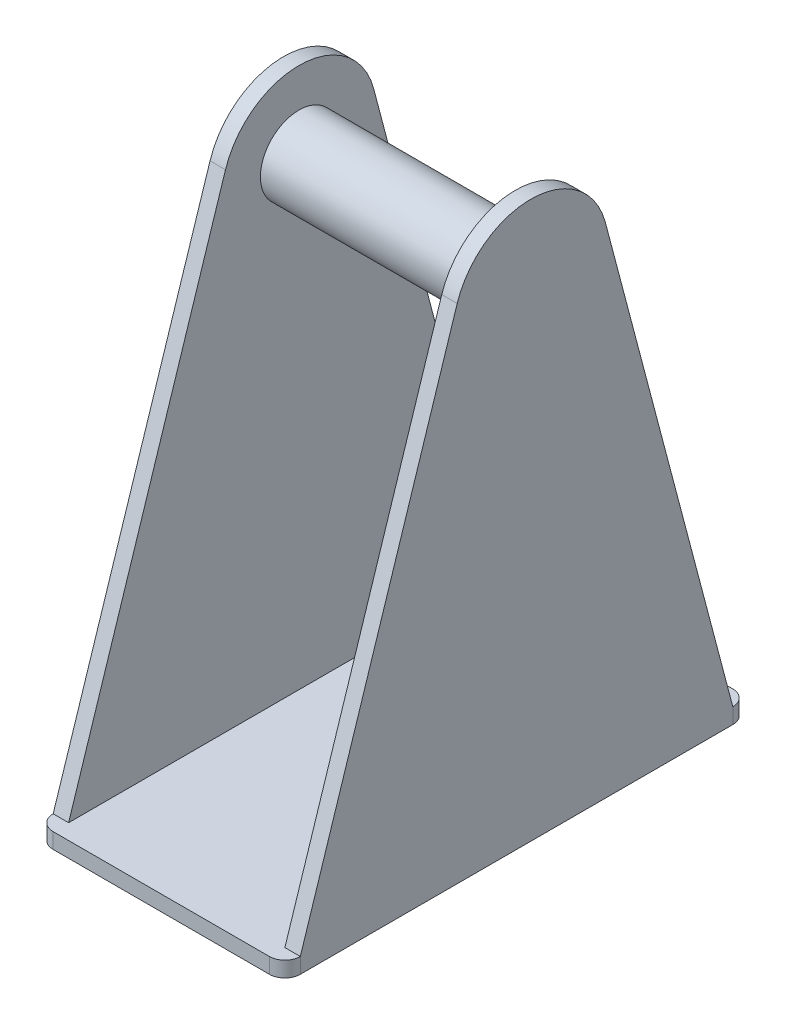
ISO-10303-21;
HEADER;
FILE_DESCRIPTION(('STEP AP214'),'2;1');
FILE_NAME('part.step','',(''),(''),'','','');
FILE_SCHEMA(('AUTOMOTIVE_DESIGN { 1 0 10303 214 1 1 1 1 }'));
ENDSEC;
DATA;
#1=APPLICATION_CONTEXT('core data for automotive mechanical design processes');
#2=APPLICATION_PROTOCOL_DEFINITION('international standard','automotive_design',2000,#1);
#3=PRODUCT_CONTEXT('',#1,'mechanical');
#4=PRODUCT('Part','Part','',(#3));
#5=PRODUCT_RELATED_PRODUCT_CATEGORY('part','',(#4));
#6=PRODUCT_DEFINITION_FORMATION('','',#4);
#7=PRODUCT_DEFINITION_CONTEXT('part definition',#1,'design');
#8=PRODUCT_DEFINITION('design','',#6,#7);
#9=PRODUCT_DEFINITION_SHAPE('','',#8);
#10=(LENGTH_UNIT() NAMED_UNIT(*) SI_UNIT(.MILLI.,.METRE.));
#11=(NAMED_UNIT(*) PLANE_ANGLE_UNIT() SI_UNIT($,.RADIAN.));
#12=(NAMED_UNIT(*) SI_UNIT($,.STERADIAN.) SOLID_ANGLE_UNIT());
#13=UNCERTAINTY_MEASURE_WITH_UNIT(LENGTH_MEASURE(1.E-05),#10,'distance_accuracy_value','');
#14=(GEOMETRIC_REPRESENTATION_CONTEXT(3) GLOBAL_UNCERTAINTY_ASSIGNED_CONTEXT((#13)) GLOBAL_UNIT_ASSIGNED_CONTEXT((#10,
#11,#12)) REPRESENTATION_CONTEXT('',''));
#15=CARTESIAN_POINT('',(0.,0.,0.));
#16=DIRECTION('',(0.,0.,1.));
#17=DIRECTION('',(1.,0.,0.));
#18=AXIS2_PLACEMENT_3D('',#15,#16,#17);
#19=CARTESIAN_POINT('',(-7.,1.,14.));
#20=DIRECTION('',(0.,1.,0.));
#21=DIRECTION('',(0.,0.,1.));
#22=AXIS2_PLACEMENT_3D('',#19,#20,#21);
#23=PLANE('',#22);
#24=CARTESIAN_POINT('',(7.,1.,14.));
#25=DIRECTION('',(0.,1.,0.));
#26=DIRECTION('',(0.,0.,1.));
#27=AXIS2_PLACEMENT_3D('',#24,#25,#26);
#28=CIRCLE('',#27,1.);
#29=CARTESIAN_POINT('',(7.,1.,15.));
#30=VERTEX_POINT('',#29);
#31=CARTESIAN_POINT('',(8.00000000000001,1.,14.));
#32=VERTEX_POINT('',#31);
#33=EDGE_CURVE('E236',#30,#32,#28,.T.);
#34=ORIENTED_EDGE('',*,*,#33,.T.);
#35=DIRECTION('',(1.,0.,0.));
#36=VECTOR('',#35,1.);
#37=CARTESIAN_POINT('',(7.,1.,14.));
#38=LINE('',#37,#36);
#39=CARTESIAN_POINT('',(7.,1.,14.));
#40=VERTEX_POINT('',#39);
#41=EDGE_CURVE('E60',#40,#32,#38,.T.);
#42=ORIENTED_EDGE('',*,*,#41,.F.);
#43=DIRECTION('',(0.,0.,1.));
#44=VECTOR('',#43,1.);
#45=CARTESIAN_POINT('',(7.,1.,14.));
#46=LINE('',#45,#44);
#47=CARTESIAN_POINT('',(6.99999999999999,1.,-14.));
#48=VERTEX_POINT('',#47);
#49=EDGE_CURVE('E55',#48,#40,#46,.T.);
#50=ORIENTED_EDGE('',*,*,#49,.F.);
#51=DIRECTION('',(1.,0.,0.));
#52=VECTOR('',#51,1.);
#53=CARTESIAN_POINT('',(6.99999999999999,1.,-14.));
#54=LINE('',#53,#52);
#55=CARTESIAN_POINT('',(7.99999999999999,1.,-14.));
#56=VERTEX_POINT('',#55);
#57=EDGE_CURVE('E162',#48,#56,#54,.T.);
#58=ORIENTED_EDGE('',*,*,#57,.T.);
#59=CARTESIAN_POINT('',(7.,1.,-14.));
#60=DIRECTION('',(0.,1.,0.));
#61=DIRECTION('',(0.,0.,1.));
#62=AXIS2_PLACEMENT_3D('',#59,#60,#61);
#63=CIRCLE('',#62,1.);
#64=CARTESIAN_POINT('',(7.,1.,-15.));
#65=VERTEX_POINT('',#64);
#66=EDGE_CURVE('E239',#56,#65,#63,.T.);
#67=ORIENTED_EDGE('',*,*,#66,.T.);
#68=DIRECTION('',(-1.,0.,0.));
#69=VECTOR('',#68,1.);
#70=CARTESIAN_POINT('',(-7.,1.,-15.));
#71=LINE('',#70,#69);
#72=CARTESIAN_POINT('',(-7.,1.,-15.));
#73=VERTEX_POINT('',#72);
#74=EDGE_CURVE('E242',#65,#73,#71,.T.);
#75=ORIENTED_EDGE('',*,*,#74,.T.);
#76=CARTESIAN_POINT('',(-7.,1.,-14.));
#77=DIRECTION('',(0.,1.,0.));
#78=DIRECTION('',(0.,0.,-1.));
#79=AXIS2_PLACEMENT_3D('',#76,#77,#78);
#80=CIRCLE('',#79,1.);
#81=CARTESIAN_POINT('',(-7.99999999999999,1.,-14.));
#82=VERTEX_POINT('',#81);
#83=EDGE_CURVE('E245',#73,#82,#80,.T.);
#84=ORIENTED_EDGE('',*,*,#83,.T.);
#85=DIRECTION('',(-1.,0.,0.));
#86=VECTOR('',#85,1.);
#87=CARTESIAN_POINT('',(-6.99999999999999,1.,-14.));
#88=LINE('',#87,#86);
#89=CARTESIAN_POINT('',(-6.99999999999999,1.,-14.));
#90=VERTEX_POINT('',#89);
#91=EDGE_CURVE('E215',#90,#82,#88,.T.);
#92=ORIENTED_EDGE('',*,*,#91,.F.);
#93=DIRECTION('',(0.,0.,1.));
#94=VECTOR('',#93,1.);
#95=CARTESIAN_POINT('',(-7.,1.,14.));
#96=LINE('',#95,#94);
#97=CARTESIAN_POINT('',(-7.,1.,14.));
#98=VERTEX_POINT('',#97);
#99=EDGE_CURVE('E187',#90,#98,#96,.T.);
#100=ORIENTED_EDGE('',*,*,#99,.T.);
#101=DIRECTION('',(-1.,0.,0.));
#102=VECTOR('',#101,1.);
#103=CARTESIAN_POINT('',(-7.,1.,14.));
#104=LINE('',#103,#102);
#105=CARTESIAN_POINT('',(-7.99999999999999,1.,14.));
#106=VERTEX_POINT('',#105);
#107=EDGE_CURVE('E204',#98,#106,#104,.T.);
#108=ORIENTED_EDGE('',*,*,#107,.T.);
#109=CARTESIAN_POINT('',(-7.,1.,14.));
#110=DIRECTION('',(0.,1.,0.));
#111=DIRECTION('',(0.,0.,1.));
#112=AXIS2_PLACEMENT_3D('',#109,#110,#111);
#113=CIRCLE('',#112,0.999999999999999);
#114=CARTESIAN_POINT('',(-7.,1.,15.));
#115=VERTEX_POINT('',#114);
#116=EDGE_CURVE('E228',#106,#115,#113,.T.);
#117=ORIENTED_EDGE('',*,*,#116,.T.);
#118=DIRECTION('',(1.,0.,0.));
#119=VECTOR('',#118,1.);
#120=CARTESIAN_POINT('',(-7.,1.,15.));
#121=LINE('',#120,#119);
#122=EDGE_CURVE('E232',#115,#30,#121,.T.);
#123=ORIENTED_EDGE('',*,*,#122,.T.);
#124=EDGE_LOOP('',(#34,#42,#50,#58,#67,#75,#84,#92,#100,#108,#117,#123));
#125=FACE_BOUND('',#124,.T.);
#126=ADVANCED_FACE('F39',(#125),#23,.T.);
#127=CARTESIAN_POINT('',(-7.,1.,14.));
#128=DIRECTION('',(0.,-1.,0.));
#129=DIRECTION('',(0.,0.,-1.));
#130=AXIS2_PLACEMENT_3D('',#127,#128,#129);
#131=CYLINDRICAL_SURFACE('',#130,0.999999999999999);
#132=CARTESIAN_POINT('',(-7.,0.,14.));
#133=DIRECTION('',(0.,1.,0.));
#134=DIRECTION('',(0.,0.,1.));
#135=AXIS2_PLACEMENT_3D('',#132,#133,#134);
#136=CIRCLE('',#135,0.999999999999999);
#137=CARTESIAN_POINT('',(-7.99999999999999,0.,14.));
#138=VERTEX_POINT('',#137);
#139=CARTESIAN_POINT('',(-7.,0.,15.));
#140=VERTEX_POINT('',#139);
#141=EDGE_CURVE('E218',#138,#140,#136,.T.);
#142=ORIENTED_EDGE('',*,*,#141,.T.);
#143=DIRECTION('',(0.,-1.,0.));
#144=VECTOR('',#143,1.);
#145=CARTESIAN_POINT('',(-7.,1.,15.));
#146=LINE('',#145,#144);
#147=EDGE_CURVE('E300',#115,#140,#146,.T.);
#148=ORIENTED_EDGE('',*,*,#147,.F.);
#149=ORIENTED_EDGE('',*,*,#116,.F.);
#150=DIRECTION('',(0.,-1.,0.));
#151=VECTOR('',#150,1.);
#152=CARTESIAN_POINT('',(-7.99999999999999,1.,14.));
#153=LINE('',#152,#151);
#154=EDGE_CURVE('E249',#106,#138,#153,.T.);
#155=ORIENTED_EDGE('',*,*,#154,.T.);
#156=EDGE_LOOP('',(#142,#148,#149,#155));
#157=FACE_BOUND('',#156,.T.);
#158=ADVANCED_FACE('F41',(#157),#131,.T.);
#159=CARTESIAN_POINT('',(-7.,1.,15.));
#160=DIRECTION('',(0.,0.,-1.));
#161=DIRECTION('',(-1.,0.,0.));
#162=AXIS2_PLACEMENT_3D('',#159,#160,#161);
#163=PLANE('',#162);
#164=DIRECTION('',(1.,0.,0.));
#165=VECTOR('',#164,1.);
#166=CARTESIAN_POINT('',(-7.,0.,15.));
#167=LINE('',#166,#165);
#168=CARTESIAN_POINT('',(7.,0.,15.));
#169=VERTEX_POINT('',#168);
#170=EDGE_CURVE('E253',#140,#169,#167,.T.);
#171=ORIENTED_EDGE('',*,*,#170,.T.);
#172=DIRECTION('',(0.,-1.,0.));
#173=VECTOR('',#172,1.);
#174=CARTESIAN_POINT('',(7.,1.,15.));
#175=LINE('',#174,#173);
#176=EDGE_CURVE('E296',#30,#169,#175,.T.);
#177=ORIENTED_EDGE('',*,*,#176,.F.);
#178=ORIENTED_EDGE('',*,*,#122,.F.);
#179=ORIENTED_EDGE('',*,*,#147,.T.);
#180=EDGE_LOOP('',(#171,#177,#178,#179));
#181=FACE_BOUND('',#180,.T.);
#182=ADVANCED_FACE('F326',(#181),#163,.F.);
#183=CARTESIAN_POINT('',(7.,1.,14.));
#184=DIRECTION('',(0.,-1.,0.));
#185=DIRECTION('',(0.,0.,-1.));
#186=AXIS2_PLACEMENT_3D('',#183,#184,#185);
#187=CYLINDRICAL_SURFACE('',#186,1.);
#188=CARTESIAN_POINT('',(7.,0.,14.));
#189=DIRECTION('',(0.,1.,0.));
#190=DIRECTION('',(0.,0.,1.));
#191=AXIS2_PLACEMENT_3D('',#188,#189,#190);
#192=CIRCLE('',#191,1.);
#193=CARTESIAN_POINT('',(8.00000000000001,0.,14.));
#194=VERTEX_POINT('',#193);
#195=EDGE_CURVE('E256',#169,#194,#192,.T.);
#196=ORIENTED_EDGE('',*,*,#195,.T.);
#197=DIRECTION('',(0.,-1.,0.));
#198=VECTOR('',#197,1.);
#199=CARTESIAN_POINT('',(8.00000000000001,1.,14.));
#200=LINE('',#199,#198);
#201=EDGE_CURVE('E292',#32,#194,#200,.T.);
#202=ORIENTED_EDGE('',*,*,#201,.F.);
#203=ORIENTED_EDGE('',*,*,#33,.F.);
#204=ORIENTED_EDGE('',*,*,#176,.T.);
#205=EDGE_LOOP('',(#196,#202,#203,#204));
#206=FACE_BOUND('',#205,.T.);
#207=ADVANCED_FACE('F356',(#206),#187,.T.);
#208=CARTESIAN_POINT('',(8.,1.,-14.));
#209=DIRECTION('',(-1.,0.,0.));
#210=DIRECTION('',(0.,0.,1.));
#211=AXIS2_PLACEMENT_3D('',#208,#209,#210);
#212=PLANE('',#211);
#213=DIRECTION('',(0.,0.,-1.));
#214=VECTOR('',#213,1.);
#215=CARTESIAN_POINT('',(8.,0.,-14.));
#216=LINE('',#215,#214);
#217=CARTESIAN_POINT('',(8.,0.,-14.));
#218=VERTEX_POINT('',#217);
#219=EDGE_CURVE('E259',#194,#218,#216,.T.);
#220=ORIENTED_EDGE('',*,*,#219,.T.);
#221=DIRECTION('',(0.,-1.,0.));
#222=VECTOR('',#221,1.);
#223=CARTESIAN_POINT('',(8.,1.,-14.));
#224=LINE('',#223,#222);
#225=EDGE_CURVE('E288',#56,#218,#224,.T.);
#226=ORIENTED_EDGE('',*,*,#225,.F.);
#227=DIRECTION('',(0.,-0.966918279333159,-0.255086340464174));
#228=VECTOR('',#227,1.);
#229=CARTESIAN_POINT('',(8.,32.2754317023209,-5.74911097462728));
#230=LINE('',#229,#228);
#231=CARTESIAN_POINT('',(8.,32.2754317023209,-5.74911097462729));
#232=VERTEX_POINT('',#231);
#233=EDGE_CURVE('E173',#232,#56,#230,.T.);
#234=ORIENTED_EDGE('',*,*,#233,.F.);
#235=CARTESIAN_POINT('',(8.,31.,-0.914519577961492));
#236=DIRECTION('',(-1.,0.,0.));
#237=DIRECTION('',(0.,0.,1.));
#238=AXIS2_PLACEMENT_3D('',#235,#236,#237);
#239=CIRCLE('',#238,5.);
#240=CARTESIAN_POINT('',(8.,32.5327433087256,3.84475536151794));
#241=VERTEX_POINT('',#240);
#242=EDGE_CURVE('E156',#241,#232,#239,.T.);
#243=ORIENTED_EDGE('',*,*,#242,.F.);
#244=DIRECTION('',(0.,0.951854987895886,-0.306548661745116));
#245=VECTOR('',#244,1.);
#246=CARTESIAN_POINT('',(8.,1.,14.));
#247=LINE('',#246,#245);
#248=EDGE_CURVE('E168',#32,#241,#247,.T.);
#249=ORIENTED_EDGE('',*,*,#248,.F.);
#250=ORIENTED_EDGE('',*,*,#201,.T.);
#251=EDGE_LOOP('',(#220,#226,#234,#243,#249,#250));
#252=FACE_BOUND('',#251,.T.);
#253=ADVANCED_FACE('F352',(#252),#212,.F.);
#254=CARTESIAN_POINT('',(7.,1.,-14.));
#255=DIRECTION('',(0.,-1.,0.));
#256=DIRECTION('',(0.,0.,-1.));
#257=AXIS2_PLACEMENT_3D('',#254,#255,#256);
#258=CYLINDRICAL_SURFACE('',#257,1.);
#259=CARTESIAN_POINT('',(7.,0.,-14.));
#260=DIRECTION('',(0.,1.,0.));
#261=DIRECTION('',(0.,0.,1.));
#262=AXIS2_PLACEMENT_3D('',#259,#260,#261);
#263=CIRCLE('',#262,1.);
#264=CARTESIAN_POINT('',(7.,0.,-15.));
#265=VERTEX_POINT('',#264);
#266=EDGE_CURVE('E262',#218,#265,#263,.T.);
#267=ORIENTED_EDGE('',*,*,#266,.T.);
#268=DIRECTION('',(0.,-1.,0.));
#269=VECTOR('',#268,1.);
#270=CARTESIAN_POINT('',(7.,1.,-15.));
#271=LINE('',#270,#269);
#272=EDGE_CURVE('E284',#65,#265,#271,.T.);
#273=ORIENTED_EDGE('',*,*,#272,.F.);
#274=ORIENTED_EDGE('',*,*,#66,.F.);
#275=ORIENTED_EDGE('',*,*,#225,.T.);
#276=EDGE_LOOP('',(#267,#273,#274,#275));
#277=FACE_BOUND('',#276,.T.);
#278=ADVANCED_FACE('F348',(#277),#258,.T.);
#279=CARTESIAN_POINT('',(-7.,1.,-15.));
#280=DIRECTION('',(0.,0.,1.));
#281=DIRECTION('',(1.,0.,0.));
#282=AXIS2_PLACEMENT_3D('',#279,#280,#281);
#283=PLANE('',#282);
#284=DIRECTION('',(-1.,0.,0.));
#285=VECTOR('',#284,1.);
#286=CARTESIAN_POINT('',(-7.,0.,-15.));
#287=LINE('',#286,#285);
#288=CARTESIAN_POINT('',(-7.,0.,-15.));
#289=VERTEX_POINT('',#288);
#290=EDGE_CURVE('E265',#265,#289,#287,.T.);
#291=ORIENTED_EDGE('',*,*,#290,.T.);
#292=DIRECTION('',(0.,-1.,0.));
#293=VECTOR('',#292,1.);
#294=CARTESIAN_POINT('',(-7.,1.,-15.));
#295=LINE('',#294,#293);
#296=EDGE_CURVE('E280',#73,#289,#295,.T.);
#297=ORIENTED_EDGE('',*,*,#296,.F.);
#298=ORIENTED_EDGE('',*,*,#74,.F.);
#299=ORIENTED_EDGE('',*,*,#272,.T.);
#300=EDGE_LOOP('',(#291,#297,#298,#299));
#301=FACE_BOUND('',#300,.T.);
#302=ADVANCED_FACE('F344',(#301),#283,.F.);
#303=CARTESIAN_POINT('',(-7.,1.,-14.));
#304=DIRECTION('',(0.,-1.,0.));
#305=DIRECTION('',(0.,0.,-1.));
#306=AXIS2_PLACEMENT_3D('',#303,#304,#305);
#307=CYLINDRICAL_SURFACE('',#306,1.);
#308=CARTESIAN_POINT('',(-7.,0.,-14.));
#309=DIRECTION('',(0.,1.,0.));
#310=DIRECTION('',(0.,0.,-1.));
#311=AXIS2_PLACEMENT_3D('',#308,#309,#310);
#312=CIRCLE('',#311,1.);
#313=CARTESIAN_POINT('',(-8.,0.,-14.));
#314=VERTEX_POINT('',#313);
#315=EDGE_CURVE('E268',#289,#314,#312,.T.);
#316=ORIENTED_EDGE('',*,*,#315,.T.);
#317=DIRECTION('',(0.,-1.,0.));
#318=VECTOR('',#317,1.);
#319=CARTESIAN_POINT('',(-8.,1.,-14.));
#320=LINE('',#319,#318);
#321=EDGE_CURVE('E276',#82,#314,#320,.T.);
#322=ORIENTED_EDGE('',*,*,#321,.F.);
#323=ORIENTED_EDGE('',*,*,#83,.F.);
#324=ORIENTED_EDGE('',*,*,#296,.T.);
#325=EDGE_LOOP('',(#316,#322,#323,#324));
#326=FACE_BOUND('',#325,.T.);
#327=ADVANCED_FACE('F340',(#326),#307,.T.);
#328=CARTESIAN_POINT('',(-8.,1.,-14.));
#329=DIRECTION('',(1.,0.,0.));
#330=DIRECTION('',(0.,0.,-1.));
#331=AXIS2_PLACEMENT_3D('',#328,#329,#330);
#332=PLANE('',#331);
#333=DIRECTION('',(0.,0.,1.));
#334=VECTOR('',#333,1.);
#335=CARTESIAN_POINT('',(-8.,0.,-14.));
#336=LINE('',#335,#334);
#337=EDGE_CURVE('E233',#314,#138,#336,.T.);
#338=ORIENTED_EDGE('',*,*,#337,.T.);
#339=ORIENTED_EDGE('',*,*,#154,.F.);
#340=DIRECTION('',(0.,0.951854987895886,-0.306548661745116));
#341=VECTOR('',#340,1.);
#342=CARTESIAN_POINT('',(-8.,1.,14.));
#343=LINE('',#342,#341);
#344=CARTESIAN_POINT('',(-8.,32.5327433087256,3.84475536151794));
#345=VERTEX_POINT('',#344);
#346=EDGE_CURVE('E182',#106,#345,#343,.T.);
#347=ORIENTED_EDGE('',*,*,#346,.T.);
#348=CARTESIAN_POINT('',(-8.,31.,-0.914519577961492));
#349=DIRECTION('',(-1.,0.,0.));
#350=DIRECTION('',(0.,0.,1.));
#351=AXIS2_PLACEMENT_3D('',#348,#349,#350);
#352=CIRCLE('',#351,5.);
#353=CARTESIAN_POINT('',(-8.,32.2754317023209,-5.74911097462729));
#354=VERTEX_POINT('',#353);
#355=EDGE_CURVE('E208',#345,#354,#352,.T.);
#356=ORIENTED_EDGE('',*,*,#355,.T.);
#357=DIRECTION('',(0.,-0.966918279333159,-0.255086340464174));
#358=VECTOR('',#357,1.);
#359=CARTESIAN_POINT('',(-8.,32.2754317023209,-5.74911097462728));
#360=LINE('',#359,#358);
#361=EDGE_CURVE('E192',#354,#82,#360,.T.);
#362=ORIENTED_EDGE('',*,*,#361,.T.);
#363=ORIENTED_EDGE('',*,*,#321,.T.);
#364=EDGE_LOOP('',(#338,#339,#347,#356,#362,#363));
#365=FACE_BOUND('',#364,.T.);
#366=ADVANCED_FACE('F336',(#365),#332,.F.);
#367=CARTESIAN_POINT('',(-7.,0.,14.));
#368=DIRECTION('',(0.,1.,0.));
#369=DIRECTION('',(0.,0.,1.));
#370=AXIS2_PLACEMENT_3D('',#367,#368,#369);
#371=PLANE('',#370);
#372=ORIENTED_EDGE('',*,*,#141,.F.);
#373=ORIENTED_EDGE('',*,*,#337,.F.);
#374=ORIENTED_EDGE('',*,*,#315,.F.);
#375=ORIENTED_EDGE('',*,*,#290,.F.);
#376=ORIENTED_EDGE('',*,*,#266,.F.);
#377=ORIENTED_EDGE('',*,*,#219,.F.);
#378=ORIENTED_EDGE('',*,*,#195,.F.);
#379=ORIENTED_EDGE('',*,*,#170,.F.);
#380=EDGE_LOOP('',(#372,#373,#374,#375,#376,#377,#378,#379));
#381=FACE_BOUND('',#380,.T.);
#382=ADVANCED_FACE('F332',(#381),#371,.F.);
#383=CARTESIAN_POINT('',(-7.,32.2754317023209,-5.74911097462728));
#384=DIRECTION('',(0.,0.255086340464173,-0.966918279333158));
#385=DIRECTION('',(0.,0.966918279333159,0.255086340464174));
#386=AXIS2_PLACEMENT_3D('',#383,#384,#385);
#387=PLANE('',#386);
#388=ORIENTED_EDGE('',*,*,#361,.F.);
#389=DIRECTION('',(-1.,0.,0.));
#390=VECTOR('',#389,1.);
#391=CARTESIAN_POINT('',(-7.,32.2754317023209,-5.74911097462729));
#392=LINE('',#391,#390);
#393=CARTESIAN_POINT('',(-7.,32.2754317023209,-5.74911097462729));
#394=VERTEX_POINT('',#393);
#395=EDGE_CURVE('E219',#394,#354,#392,.T.);
#396=ORIENTED_EDGE('',*,*,#395,.F.);
#397=DIRECTION('',(0.,-0.966918279333159,-0.255086340464174));
#398=VECTOR('',#397,1.);
#399=CARTESIAN_POINT('',(-7.,32.2754317023209,-5.74911097462728));
#400=LINE('',#399,#398);
#401=EDGE_CURVE('E200',#394,#90,#400,.T.);
#402=ORIENTED_EDGE('',*,*,#401,.T.);
#403=ORIENTED_EDGE('',*,*,#91,.T.);
#404=EDGE_LOOP('',(#388,#396,#402,#403));
#405=FACE_BOUND('',#404,.T.);
#406=ADVANCED_FACE('F335',(#405),#387,.T.);
#407=CARTESIAN_POINT('',(-7.,31.,-0.914519577961492));
#408=DIRECTION('',(-1.,0.,0.));
#409=DIRECTION('',(0.,0.,1.));
#410=AXIS2_PLACEMENT_3D('',#407,#408,#409);
#411=CYLINDRICAL_SURFACE('',#410,5.);
#412=ORIENTED_EDGE('',*,*,#355,.F.);
#413=DIRECTION('',(-1.,0.,0.));
#414=VECTOR('',#413,1.);
#415=CARTESIAN_POINT('',(-7.,32.5327433087256,3.84475536151794));
#416=LINE('',#415,#414);
#417=CARTESIAN_POINT('',(-7.,32.5327433087256,3.84475536151794));
#418=VERTEX_POINT('',#417);
#419=EDGE_CURVE('E222',#418,#345,#416,.T.);
#420=ORIENTED_EDGE('',*,*,#419,.F.);
#421=CARTESIAN_POINT('',(-7.,31.,-0.914519577961492));
#422=DIRECTION('',(-1.,0.,0.));
#423=DIRECTION('',(0.,0.,1.));
#424=AXIS2_PLACEMENT_3D('',#421,#422,#423);
#425=CIRCLE('',#424,5.);
#426=EDGE_CURVE('E196',#418,#394,#425,.T.);
#427=ORIENTED_EDGE('',*,*,#426,.T.);
#428=ORIENTED_EDGE('',*,*,#395,.T.);
#429=EDGE_LOOP('',(#412,#420,#427,#428));
#430=FACE_BOUND('',#429,.T.);
#431=ADVANCED_FACE('F391',(#430),#411,.T.);
#432=CARTESIAN_POINT('',(-7.,1.,14.));
#433=DIRECTION('',(0.,0.306548661745116,0.951854987895886));
#434=DIRECTION('',(0.,-0.951854987895886,0.306548661745116));
#435=AXIS2_PLACEMENT_3D('',#432,#433,#434);
#436=PLANE('',#435);
#437=ORIENTED_EDGE('',*,*,#346,.F.);
#438=ORIENTED_EDGE('',*,*,#107,.F.);
#439=DIRECTION('',(0.,0.951854987895886,-0.306548661745116));
#440=VECTOR('',#439,1.);
#441=CARTESIAN_POINT('',(-7.,1.,14.));
#442=LINE('',#441,#440);
#443=EDGE_CURVE('E191',#98,#418,#442,.T.);
#444=ORIENTED_EDGE('',*,*,#443,.T.);
#445=ORIENTED_EDGE('',*,*,#419,.T.);
#446=EDGE_LOOP('',(#437,#438,#444,#445));
#447=FACE_BOUND('',#446,.T.);
#448=ADVANCED_FACE('F330',(#447),#436,.T.);
#449=CARTESIAN_POINT('',(-7.,31.,-0.914519577961492));
#450=DIRECTION('',(-1.,0.,0.));
#451=DIRECTION('',(0.,0.,1.));
#452=AXIS2_PLACEMENT_3D('',#449,#450,#451);
#453=PLANE('',#452);
#454=CARTESIAN_POINT('',(-7.,31.,-0.914519577961493));
#455=DIRECTION('',(-1.,0.,0.));
#456=DIRECTION('',(0.,0.,1.));
#457=AXIS2_PLACEMENT_3D('',#454,#455,#456);
#458=CIRCLE('',#457,2.5);
#459=CARTESIAN_POINT('',(-7.,31.,1.58548042203851));
#460=VERTEX_POINT('',#459);
#461=EDGE_CURVE('E11',#460,#460,#458,.F.);
#462=ORIENTED_EDGE('',*,*,#461,.F.);
#463=EDGE_LOOP('',(#462));
#464=FACE_BOUND('',#463,.T.);
#465=ORIENTED_EDGE('',*,*,#99,.F.);
#466=ORIENTED_EDGE('',*,*,#401,.F.);
#467=ORIENTED_EDGE('',*,*,#426,.F.);
#468=ORIENTED_EDGE('',*,*,#443,.F.);
#469=EDGE_LOOP('',(#465,#466,#467,#468));
#470=FACE_BOUND('',#469,.T.);
#471=ADVANCED_FACE('F381',(#464,#470),#453,.F.);
#472=CARTESIAN_POINT('',(7.,1.,14.));
#473=DIRECTION('',(0.,-0.306548661745116,-0.951854987895886));
#474=DIRECTION('',(0.,0.951854987895886,-0.306548661745116));
#475=AXIS2_PLACEMENT_3D('',#472,#473,#474);
#476=PLANE('',#475);
#477=ORIENTED_EDGE('',*,*,#248,.T.);
#478=DIRECTION('',(1.,0.,0.));
#479=VECTOR('',#478,1.);
#480=CARTESIAN_POINT('',(7.,32.5327433087256,3.84475536151794));
#481=LINE('',#480,#479);
#482=CARTESIAN_POINT('',(7.,32.5327433087256,3.84475536151794));
#483=VERTEX_POINT('',#482);
#484=EDGE_CURVE('E161',#483,#241,#481,.T.);
#485=ORIENTED_EDGE('',*,*,#484,.F.);
#486=DIRECTION('',(0.,0.951854987895886,-0.306548661745116));
#487=VECTOR('',#486,1.);
#488=CARTESIAN_POINT('',(7.,1.,14.));
#489=LINE('',#488,#487);
#490=EDGE_CURVE('E146',#40,#483,#489,.T.);
#491=ORIENTED_EDGE('',*,*,#490,.F.);
#492=ORIENTED_EDGE('',*,*,#41,.T.);
#493=EDGE_LOOP('',(#477,#485,#491,#492));
#494=FACE_BOUND('',#493,.T.);
#495=ADVANCED_FACE('F379',(#494),#476,.F.);
#496=CARTESIAN_POINT('',(7.,31.,-0.914519577961492));
#497=DIRECTION('',(1.,0.,0.));
#498=DIRECTION('',(0.,0.,-1.));
#499=AXIS2_PLACEMENT_3D('',#496,#497,#498);
#500=CYLINDRICAL_SURFACE('',#499,5.);
#501=ORIENTED_EDGE('',*,*,#242,.T.);
#502=DIRECTION('',(1.,0.,0.));
#503=VECTOR('',#502,1.);
#504=CARTESIAN_POINT('',(7.,32.2754317023209,-5.74911097462729));
#505=LINE('',#504,#503);
#506=CARTESIAN_POINT('',(7.,32.2754317023209,-5.74911097462729));
#507=VERTEX_POINT('',#506);
#508=EDGE_CURVE('E153',#507,#232,#505,.T.);
#509=ORIENTED_EDGE('',*,*,#508,.F.);
#510=CARTESIAN_POINT('',(7.,31.,-0.914519577961492));
#511=DIRECTION('',(-1.,0.,0.));
#512=DIRECTION('',(0.,0.,1.));
#513=AXIS2_PLACEMENT_3D('',#510,#511,#512);
#514=CIRCLE('',#513,5.);
#515=EDGE_CURVE('E140',#483,#507,#514,.T.);
#516=ORIENTED_EDGE('',*,*,#515,.F.);
#517=ORIENTED_EDGE('',*,*,#484,.T.);
#518=EDGE_LOOP('',(#501,#509,#516,#517));
#519=FACE_BOUND('',#518,.T.);
#520=ADVANCED_FACE('F154',(#519),#500,.T.);
#521=CARTESIAN_POINT('',(7.,32.2754317023209,-5.74911097462728));
#522=DIRECTION('',(0.,-0.255086340464173,0.966918279333158));
#523=DIRECTION('',(0.,-0.966918279333159,-0.255086340464174));
#524=AXIS2_PLACEMENT_3D('',#521,#522,#523);
#525=PLANE('',#524);
#526=ORIENTED_EDGE('',*,*,#233,.T.);
#527=ORIENTED_EDGE('',*,*,#57,.F.);
#528=DIRECTION('',(0.,-0.966918279333159,-0.255086340464174));
#529=VECTOR('',#528,1.);
#530=CARTESIAN_POINT('',(7.,32.2754317023209,-5.74911097462728));
#531=LINE('',#530,#529);
#532=EDGE_CURVE('E144',#507,#48,#531,.T.);
#533=ORIENTED_EDGE('',*,*,#532,.F.);
#534=ORIENTED_EDGE('',*,*,#508,.T.);
#535=EDGE_LOOP('',(#526,#527,#533,#534));
#536=FACE_BOUND('',#535,.T.);
#537=ADVANCED_FACE('F164',(#536),#525,.F.);
#538=CARTESIAN_POINT('',(7.,31.,-0.914519577961492));
#539=DIRECTION('',(1.,0.,0.));
#540=DIRECTION('',(0.,0.,1.));
#541=AXIS2_PLACEMENT_3D('',#538,#539,#540);
#542=PLANE('',#541);
#543=CARTESIAN_POINT('',(7.,31.,-0.914519577961492));
#544=DIRECTION('',(1.,0.,0.));
#545=DIRECTION('',(0.,0.,-1.));
#546=AXIS2_PLACEMENT_3D('',#543,#544,#545);
#547=CIRCLE('',#546,2.5);
#548=CARTESIAN_POINT('',(7.,31.,-3.41451957796149));
#549=VERTEX_POINT('',#548);
#550=EDGE_CURVE('E48',#549,#549,#547,.F.);
#551=ORIENTED_EDGE('',*,*,#550,.F.);
#552=EDGE_LOOP('',(#551));
#553=FACE_BOUND('',#552,.T.);
#554=ORIENTED_EDGE('',*,*,#49,.T.);
#555=ORIENTED_EDGE('',*,*,#490,.T.);
#556=ORIENTED_EDGE('',*,*,#515,.T.);
#557=ORIENTED_EDGE('',*,*,#532,.T.);
#558=EDGE_LOOP('',(#554,#555,#556,#557));
#559=FACE_BOUND('',#558,.T.);
#560=ADVANCED_FACE('F142',(#553,#559),#542,.F.);
#561=CARTESIAN_POINT('',(8.002,31.,-0.914519577961492));
#562=DIRECTION('',(-1.,0.,0.));
#563=DIRECTION('',(0.,0.,1.));
#564=AXIS2_PLACEMENT_3D('',#561,#562,#563);
#565=CYLINDRICAL_SURFACE('',#564,2.5);
#566=ORIENTED_EDGE('',*,*,#461,.T.);
#567=EDGE_LOOP('',(#566));
#568=FACE_BOUND('',#567,.T.);
#569=ORIENTED_EDGE('',*,*,#550,.T.);
#570=EDGE_LOOP('',(#569));
#571=FACE_BOUND('',#570,.T.);
#572=ADVANCED_FACE('F307',(#568,#571),#565,.T.);
#573=CLOSED_SHELL('',(#126,#158,#182,#207,#253,#278,#302,#327,#366,#382,#406,#431,#448,#471,
#495,#520,#537,#560,#572));
#574=MANIFOLD_SOLID_BREP('B2',#573);
#575=ADVANCED_BREP_SHAPE_REPRESENTATION('',(#18,#574),#14);
#576=SHAPE_DEFINITION_REPRESENTATION(#9,#575);
ENDSEC;
END-ISO-10303-21;
